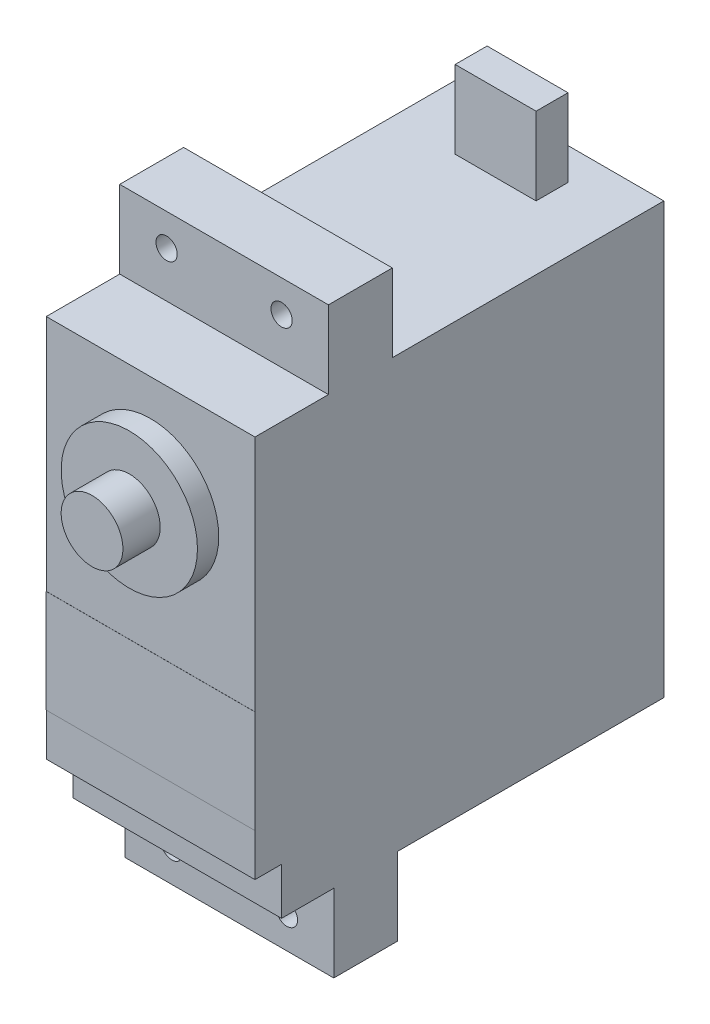
ISO-10303-21;
HEADER;
FILE_DESCRIPTION(('STEP AP214'),'2;1');
FILE_NAME('part.step','',(''),(''),'','','');
FILE_SCHEMA(('AUTOMOTIVE_DESIGN { 1 0 10303 214 1 1 1 1 }'));
ENDSEC;
DATA;
#1=APPLICATION_CONTEXT('core data for automotive mechanical design processes');
#2=APPLICATION_PROTOCOL_DEFINITION('international standard','automotive_design',2000,#1);
#3=PRODUCT_CONTEXT('',#1,'mechanical');
#4=PRODUCT('Part','Part','',(#3));
#5=PRODUCT_RELATED_PRODUCT_CATEGORY('part','',(#4));
#6=PRODUCT_DEFINITION_FORMATION('','',#4);
#7=PRODUCT_DEFINITION_CONTEXT('part definition',#1,'design');
#8=PRODUCT_DEFINITION('design','',#6,#7);
#9=PRODUCT_DEFINITION_SHAPE('','',#8);
#10=(LENGTH_UNIT() NAMED_UNIT(*) SI_UNIT(.MILLI.,.METRE.));
#11=(NAMED_UNIT(*) PLANE_ANGLE_UNIT() SI_UNIT($,.RADIAN.));
#12=(NAMED_UNIT(*) SI_UNIT($,.STERADIAN.) SOLID_ANGLE_UNIT());
#13=UNCERTAINTY_MEASURE_WITH_UNIT(LENGTH_MEASURE(1.E-05),#10,'distance_accuracy_value','');
#14=(GEOMETRIC_REPRESENTATION_CONTEXT(3) GLOBAL_UNCERTAINTY_ASSIGNED_CONTEXT((#13)) GLOBAL_UNIT_ASSIGNED_CONTEXT((#10,
#11,#12)) REPRESENTATION_CONTEXT('',''));
#15=CARTESIAN_POINT('',(0.,0.,0.));
#16=DIRECTION('',(0.,0.,1.));
#17=DIRECTION('',(1.,0.,0.));
#18=AXIS2_PLACEMENT_3D('',#15,#16,#17);
#19=CARTESIAN_POINT('',(0.,0.,38.4));
#20=DIRECTION('',(0.,0.,1.));
#21=DIRECTION('',(1.,0.,0.));
#22=AXIS2_PLACEMENT_3D('',#19,#20,#21);
#23=PLANE('',#22);
#24=DIRECTION('',(0.,1.,0.));
#25=VECTOR('',#24,1.);
#26=CARTESIAN_POINT('',(35.4646184858892,20.4232044198895,38.4));
#27=LINE('',#26,#25);
#28=CARTESIAN_POINT('',(35.4646184858892,-15.5767955801105,38.4));
#29=VERTEX_POINT('',#28);
#30=CARTESIAN_POINT('',(35.4646184858892,-11.5767955801105,38.4));
#31=VERTEX_POINT('',#30);
#32=EDGE_CURVE('E60',#29,#31,#27,.T.);
#33=ORIENTED_EDGE('',*,*,#32,.T.);
#34=DIRECTION('',(1.,0.,0.));
#35=VECTOR('',#34,1.);
#36=CARTESIAN_POINT('',(15.8646184858892,-11.5767955801105,38.4));
#37=LINE('',#36,#35);
#38=CARTESIAN_POINT('',(15.8646184858892,-11.5767955801105,38.4));
#39=VERTEX_POINT('',#38);
#40=EDGE_CURVE('E210',#39,#31,#37,.T.);
#41=ORIENTED_EDGE('',*,*,#40,.F.);
#42=DIRECTION('',(0.,-1.,0.));
#43=VECTOR('',#42,1.);
#44=CARTESIAN_POINT('',(15.8646184858892,20.4232044198895,38.4));
#45=LINE('',#44,#43);
#46=CARTESIAN_POINT('',(15.8646184858892,-15.5767955801105,38.4));
#47=VERTEX_POINT('',#46);
#48=EDGE_CURVE('E323',#39,#47,#45,.T.);
#49=ORIENTED_EDGE('',*,*,#48,.T.);
#50=DIRECTION('',(1.,0.,0.));
#51=VECTOR('',#50,1.);
#52=CARTESIAN_POINT('',(15.8646184858892,-15.5767955801105,38.4));
#53=LINE('',#52,#51);
#54=EDGE_CURVE('E322',#47,#29,#53,.T.);
#55=ORIENTED_EDGE('',*,*,#54,.T.);
#56=EDGE_LOOP('',(#33,#41,#49,#55));
#57=FACE_BOUND('',#56,.T.);
#58=ADVANCED_FACE('F35',(#57),#23,.T.);
#59=CARTESIAN_POINT('',(15.8646184858892,-19.9767955801105,35.9));
#60=DIRECTION('',(0.,1.,0.));
#61=DIRECTION('',(-1.,0.,0.));
#62=AXIS2_PLACEMENT_3D('',#59,#60,#61);
#63=PLANE('',#62);
#64=DIRECTION('',(1.,0.,0.));
#65=VECTOR('',#64,1.);
#66=CARTESIAN_POINT('',(0.,-19.9767955801105,25.));
#67=LINE('',#66,#65);
#68=CARTESIAN_POINT('',(15.8646184858892,-19.9767955801105,25.));
#69=VERTEX_POINT('',#68);
#70=CARTESIAN_POINT('',(35.4646184858892,-19.9767955801105,25.));
#71=VERTEX_POINT('',#70);
#72=EDGE_CURVE('E272',#69,#71,#67,.T.);
#73=ORIENTED_EDGE('',*,*,#72,.F.);
#74=DIRECTION('',(0.,0.,-1.));
#75=VECTOR('',#74,1.);
#76=CARTESIAN_POINT('',(15.8646184858892,-19.9767955801105,35.9));
#77=LINE('',#76,#75);
#78=CARTESIAN_POINT('',(15.8646184858892,-19.9767955801105,0.));
#79=VERTEX_POINT('',#78);
#80=EDGE_CURVE('E366',#69,#79,#77,.T.);
#81=ORIENTED_EDGE('',*,*,#80,.T.);
#82=DIRECTION('',(1.,0.,0.));
#83=VECTOR('',#82,1.);
#84=CARTESIAN_POINT('',(15.8646184858892,-19.9767955801105,0.));
#85=LINE('',#84,#83);
#86=CARTESIAN_POINT('',(35.4646184858892,-19.9767955801105,0.));
#87=VERTEX_POINT('',#86);
#88=EDGE_CURVE('E348',#79,#87,#85,.T.);
#89=ORIENTED_EDGE('',*,*,#88,.T.);
#90=DIRECTION('',(0.,0.,-1.));
#91=VECTOR('',#90,1.);
#92=CARTESIAN_POINT('',(35.4646184858892,-19.9767955801105,35.9));
#93=LINE('',#92,#91);
#94=EDGE_CURVE('E362',#71,#87,#93,.T.);
#95=ORIENTED_EDGE('',*,*,#94,.F.);
#96=EDGE_LOOP('',(#73,#81,#89,#95));
#97=FACE_BOUND('',#96,.T.);
#98=ADVANCED_FACE('F462',(#97),#63,.F.);
#99=CARTESIAN_POINT('',(15.8646184858892,20.4232044198895,35.9));
#100=DIRECTION('',(0.,-1.,0.));
#101=DIRECTION('',(0.,0.,-1.));
#102=AXIS2_PLACEMENT_3D('',#99,#100,#101);
#103=PLANE('',#102);
#104=DIRECTION('',(1.,0.,0.));
#105=VECTOR('',#104,1.);
#106=CARTESIAN_POINT('',(0.,20.4232044198895,3.));
#107=LINE('',#106,#105);
#108=CARTESIAN_POINT('',(21.8646184858892,20.4232044198895,3.));
#109=VERTEX_POINT('',#108);
#110=CARTESIAN_POINT('',(29.4646184858892,20.4232044198895,3.));
#111=VERTEX_POINT('',#110);
#112=EDGE_CURVE('E249',#109,#111,#107,.T.);
#113=ORIENTED_EDGE('',*,*,#112,.T.);
#114=DIRECTION('',(0.,0.,1.));
#115=VECTOR('',#114,1.);
#116=CARTESIAN_POINT('',(29.4646184858892,20.4232044198895,0.));
#117=LINE('',#116,#115);
#118=CARTESIAN_POINT('',(29.4646184858892,20.4232044198895,6.));
#119=VERTEX_POINT('',#118);
#120=EDGE_CURVE('E232',#111,#119,#117,.T.);
#121=ORIENTED_EDGE('',*,*,#120,.T.);
#122=DIRECTION('',(1.,0.,0.));
#123=VECTOR('',#122,1.);
#124=CARTESIAN_POINT('',(0.,20.4232044198895,6.));
#125=LINE('',#124,#123);
#126=CARTESIAN_POINT('',(21.8646184858892,20.4232044198895,6.));
#127=VERTEX_POINT('',#126);
#128=EDGE_CURVE('E240',#127,#119,#125,.T.);
#129=ORIENTED_EDGE('',*,*,#128,.F.);
#130=DIRECTION('',(0.,0.,1.));
#131=VECTOR('',#130,1.);
#132=CARTESIAN_POINT('',(21.8646184858892,20.4232044198895,0.));
#133=LINE('',#132,#131);
#134=EDGE_CURVE('E251',#109,#127,#133,.T.);
#135=ORIENTED_EDGE('',*,*,#134,.F.);
#136=EDGE_LOOP('',(#113,#121,#129,#135));
#137=FACE_BOUND('',#136,.T.);
#138=DIRECTION('',(-1.,0.,0.));
#139=VECTOR('',#138,1.);
#140=CARTESIAN_POINT('',(0.,20.4232044198895,25.4998346045456));
#141=LINE('',#140,#139);
#142=CARTESIAN_POINT('',(35.4646184858892,20.4232044198895,25.4998346045456));
#143=VERTEX_POINT('',#142);
#144=CARTESIAN_POINT('',(15.8646184858892,20.4232044198895,25.4998346045456));
#145=VERTEX_POINT('',#144);
#146=EDGE_CURVE('E298',#143,#145,#141,.T.);
#147=ORIENTED_EDGE('',*,*,#146,.F.);
#148=DIRECTION('',(0.,0.,-1.));
#149=VECTOR('',#148,1.);
#150=CARTESIAN_POINT('',(35.4646184858892,20.4232044198895,35.9));
#151=LINE('',#150,#149);
#152=CARTESIAN_POINT('',(35.4646184858892,20.4232044198895,0.));
#153=VERTEX_POINT('',#152);
#154=EDGE_CURVE('E359',#143,#153,#151,.T.);
#155=ORIENTED_EDGE('',*,*,#154,.T.);
#156=DIRECTION('',(-1.,0.,0.));
#157=VECTOR('',#156,1.);
#158=CARTESIAN_POINT('',(15.8646184858892,20.4232044198895,0.));
#159=LINE('',#158,#157);
#160=CARTESIAN_POINT('',(15.8646184858892,20.4232044198895,0.));
#161=VERTEX_POINT('',#160);
#162=EDGE_CURVE('E342',#153,#161,#159,.T.);
#163=ORIENTED_EDGE('',*,*,#162,.T.);
#164=DIRECTION('',(0.,0.,-1.));
#165=VECTOR('',#164,1.);
#166=CARTESIAN_POINT('',(15.8646184858892,20.4232044198895,35.9));
#167=LINE('',#166,#165);
#168=EDGE_CURVE('E346',#145,#161,#167,.T.);
#169=ORIENTED_EDGE('',*,*,#168,.F.);
#170=EDGE_LOOP('',(#147,#155,#163,#169));
#171=FACE_BOUND('',#170,.T.);
#172=ADVANCED_FACE('F421',(#137,#171),#103,.F.);
#173=CARTESIAN_POINT('',(15.8646184858892,20.4232044198895,35.9));
#174=DIRECTION('',(1.,0.,0.));
#175=DIRECTION('',(0.,1.,0.));
#176=AXIS2_PLACEMENT_3D('',#173,#174,#175);
#177=PLANE('',#176);
#178=DIRECTION('',(0.,-1.,0.));
#179=VECTOR('',#178,1.);
#180=CARTESIAN_POINT('',(15.8646184858892,20.4232044198895,0.));
#181=LINE('',#180,#179);
#182=EDGE_CURVE('E338',#161,#79,#181,.T.);
#183=ORIENTED_EDGE('',*,*,#182,.T.);
#184=ORIENTED_EDGE('',*,*,#80,.F.);
#185=DIRECTION('',(0.,1.,0.));
#186=VECTOR('',#185,1.);
#187=CARTESIAN_POINT('',(15.8646184858892,-27.2767955801105,25.));
#188=LINE('',#187,#186);
#189=CARTESIAN_POINT('',(15.8646184858892,-27.2767955801105,25.));
#190=VERTEX_POINT('',#189);
#191=EDGE_CURVE('E287',#190,#69,#188,.T.);
#192=ORIENTED_EDGE('',*,*,#191,.F.);
#193=DIRECTION('',(0.,0.,-1.));
#194=VECTOR('',#193,1.);
#195=CARTESIAN_POINT('',(15.8646184858892,-27.2767955801105,0.));
#196=LINE('',#195,#194);
#197=CARTESIAN_POINT('',(15.8646184858892,-27.2767955801105,31.));
#198=VERTEX_POINT('',#197);
#199=EDGE_CURVE('E271',#198,#190,#196,.T.);
#200=ORIENTED_EDGE('',*,*,#199,.F.);
#201=DIRECTION('',(0.,1.,0.));
#202=VECTOR('',#201,1.);
#203=CARTESIAN_POINT('',(15.8646184858892,-27.2767955801105,31.));
#204=LINE('',#203,#202);
#205=CARTESIAN_POINT('',(15.8646184858892,-19.9767955801105,31.));
#206=VERTEX_POINT('',#205);
#207=EDGE_CURVE('E290',#198,#206,#204,.T.);
#208=ORIENTED_EDGE('',*,*,#207,.T.);
#209=CARTESIAN_POINT('',(15.8646184858892,-19.9767955801105,35.9));
#210=VERTEX_POINT('',#209);
#211=EDGE_CURVE('E235',#210,#206,#77,.T.);
#212=ORIENTED_EDGE('',*,*,#211,.F.);
#213=DIRECTION('',(0.,-1.,0.));
#214=VECTOR('',#213,1.);
#215=CARTESIAN_POINT('',(15.8646184858892,20.4232044198895,35.9));
#216=LINE('',#215,#214);
#217=CARTESIAN_POINT('',(15.8646184858892,-15.5767955801105,35.9));
#218=VERTEX_POINT('',#217);
#219=EDGE_CURVE('E339',#218,#210,#216,.T.);
#220=ORIENTED_EDGE('',*,*,#219,.F.);
#221=DIRECTION('',(0.,0.,-1.));
#222=VECTOR('',#221,1.);
#223=CARTESIAN_POINT('',(15.8646184858892,-15.5767955801105,38.4));
#224=LINE('',#223,#222);
#225=EDGE_CURVE('E335',#47,#218,#224,.T.);
#226=ORIENTED_EDGE('',*,*,#225,.F.);
#227=ORIENTED_EDGE('',*,*,#48,.F.);
#228=DIRECTION('',(0.,0.,-1.));
#229=VECTOR('',#228,1.);
#230=CARTESIAN_POINT('',(15.8646184858892,-11.5767955801105,38.41));
#231=LINE('',#230,#229);
#232=CARTESIAN_POINT('',(15.8646184858892,-11.5767955801105,38.41));
#233=VERTEX_POINT('',#232);
#234=EDGE_CURVE('E208',#233,#39,#231,.T.);
#235=ORIENTED_EDGE('',*,*,#234,.F.);
#236=DIRECTION('',(0.,1.,0.));
#237=VECTOR('',#236,1.);
#238=CARTESIAN_POINT('',(15.8646184858892,-11.5767955801105,38.41));
#239=LINE('',#238,#237);
#240=CARTESIAN_POINT('',(15.8646184858892,-1.92679558011051,38.41));
#241=VERTEX_POINT('',#240);
#242=EDGE_CURVE('E200',#233,#241,#239,.T.);
#243=ORIENTED_EDGE('',*,*,#242,.T.);
#244=DIRECTION('',(0.,0.,-1.));
#245=VECTOR('',#244,1.);
#246=CARTESIAN_POINT('',(15.8646184858892,-1.92679558011051,38.41));
#247=LINE('',#246,#245);
#248=CARTESIAN_POINT('',(15.8646184858892,-1.92679558011051,38.4));
#249=VERTEX_POINT('',#248);
#250=EDGE_CURVE('E186',#241,#249,#247,.T.);
#251=ORIENTED_EDGE('',*,*,#250,.T.);
#252=CARTESIAN_POINT('',(15.8646184858892,20.4232044198895,38.4));
#253=VERTEX_POINT('',#252);
#254=EDGE_CURVE('E320',#253,#249,#45,.T.);
#255=ORIENTED_EDGE('',*,*,#254,.F.);
#256=CARTESIAN_POINT('',(15.8646184858892,20.4232044198895,31.4998346045456));
#257=VERTEX_POINT('',#256);
#258=EDGE_CURVE('E356',#253,#257,#167,.T.);
#259=ORIENTED_EDGE('',*,*,#258,.T.);
#260=DIRECTION('',(0.,-1.,0.));
#261=VECTOR('',#260,1.);
#262=CARTESIAN_POINT('',(15.8646184858892,27.7232044198895,31.4998346045456));
#263=LINE('',#262,#261);
#264=CARTESIAN_POINT('',(15.8646184858892,27.7232044198895,31.4998346045456));
#265=VERTEX_POINT('',#264);
#266=EDGE_CURVE('E304',#265,#257,#263,.T.);
#267=ORIENTED_EDGE('',*,*,#266,.F.);
#268=DIRECTION('',(0.,0.,1.));
#269=VECTOR('',#268,1.);
#270=CARTESIAN_POINT('',(15.8646184858892,27.7232044198895,0.));
#271=LINE('',#270,#269);
#272=CARTESIAN_POINT('',(15.8646184858892,27.7232044198895,25.4998346045456));
#273=VERTEX_POINT('',#272);
#274=EDGE_CURVE('E302',#273,#265,#271,.T.);
#275=ORIENTED_EDGE('',*,*,#274,.F.);
#276=DIRECTION('',(0.,-1.,0.));
#277=VECTOR('',#276,1.);
#278=CARTESIAN_POINT('',(15.8646184858892,27.7232044198895,25.4998346045456));
#279=LINE('',#278,#277);
#280=EDGE_CURVE('E310',#273,#145,#279,.T.);
#281=ORIENTED_EDGE('',*,*,#280,.T.);
#282=ORIENTED_EDGE('',*,*,#168,.T.);
#283=EDGE_LOOP('',(#183,#184,#192,#200,#208,#212,#220,#226,#227,#235,#243,#251,#255,#259,#267,
#275,#281,#282));
#284=FACE_BOUND('',#283,.T.);
#285=ADVANCED_FACE('F37',(#284),#177,.F.);
#286=ORIENTED_EDGE('',*,*,#211,.T.);
#287=DIRECTION('',(1.,0.,0.));
#288=VECTOR('',#287,1.);
#289=CARTESIAN_POINT('',(0.,-19.9767955801105,31.));
#290=LINE('',#289,#288);
#291=CARTESIAN_POINT('',(35.4646184858892,-19.9767955801105,31.));
#292=VERTEX_POINT('',#291);
#293=EDGE_CURVE('E267',#206,#292,#290,.T.);
#294=ORIENTED_EDGE('',*,*,#293,.T.);
#295=CARTESIAN_POINT('',(35.4646184858892,-19.9767955801105,35.9));
#296=VERTEX_POINT('',#295);
#297=EDGE_CURVE('E363',#296,#292,#93,.T.);
#298=ORIENTED_EDGE('',*,*,#297,.F.);
#299=DIRECTION('',(1.,0.,0.));
#300=VECTOR('',#299,1.);
#301=CARTESIAN_POINT('',(15.8646184858892,-19.9767955801105,35.9));
#302=LINE('',#301,#300);
#303=EDGE_CURVE('E341',#210,#296,#302,.T.);
#304=ORIENTED_EDGE('',*,*,#303,.F.);
#305=EDGE_LOOP('',(#286,#294,#298,#304));
#306=FACE_BOUND('',#305,.T.);
#307=ADVANCED_FACE('F448',(#306),#63,.F.);
#308=CARTESIAN_POINT('',(35.4646184858892,20.4232044198895,35.9));
#309=DIRECTION('',(-1.,0.,0.));
#310=DIRECTION('',(0.,0.,1.));
#311=AXIS2_PLACEMENT_3D('',#308,#309,#310);
#312=PLANE('',#311);
#313=DIRECTION('',(0.,1.,0.));
#314=VECTOR('',#313,1.);
#315=CARTESIAN_POINT('',(35.4646184858892,20.4232044198895,0.));
#316=LINE('',#315,#314);
#317=EDGE_CURVE('E351',#87,#153,#316,.T.);
#318=ORIENTED_EDGE('',*,*,#317,.T.);
#319=ORIENTED_EDGE('',*,*,#154,.F.);
#320=DIRECTION('',(0.,-1.,0.));
#321=VECTOR('',#320,1.);
#322=CARTESIAN_POINT('',(35.4646184858892,27.7232044198895,25.4998346045456));
#323=LINE('',#322,#321);
#324=CARTESIAN_POINT('',(35.4646184858892,27.7232044198895,25.4998346045456));
#325=VERTEX_POINT('',#324);
#326=EDGE_CURVE('E313',#325,#143,#323,.T.);
#327=ORIENTED_EDGE('',*,*,#326,.F.);
#328=DIRECTION('',(0.,0.,-1.));
#329=VECTOR('',#328,1.);
#330=CARTESIAN_POINT('',(35.4646184858892,27.7232044198895,0.));
#331=LINE('',#330,#329);
#332=CARTESIAN_POINT('',(35.4646184858892,27.7232044198895,31.4998346045456));
#333=VERTEX_POINT('',#332);
#334=EDGE_CURVE('E297',#333,#325,#331,.T.);
#335=ORIENTED_EDGE('',*,*,#334,.F.);
#336=DIRECTION('',(0.,-1.,0.));
#337=VECTOR('',#336,1.);
#338=CARTESIAN_POINT('',(35.4646184858892,27.7232044198895,31.4998346045456));
#339=LINE('',#338,#337);
#340=CARTESIAN_POINT('',(35.4646184858892,20.4232044198895,31.4998346045456));
#341=VERTEX_POINT('',#340);
#342=EDGE_CURVE('E316',#333,#341,#339,.T.);
#343=ORIENTED_EDGE('',*,*,#342,.T.);
#344=CARTESIAN_POINT('',(35.4646184858892,20.4232044198895,38.4));
#345=VERTEX_POINT('',#344);
#346=EDGE_CURVE('E360',#345,#341,#151,.T.);
#347=ORIENTED_EDGE('',*,*,#346,.F.);
#348=CARTESIAN_POINT('',(35.4646184858892,-1.92679558011051,38.4));
#349=VERTEX_POINT('',#348);
#350=EDGE_CURVE('E325',#349,#345,#27,.T.);
#351=ORIENTED_EDGE('',*,*,#350,.F.);
#352=DIRECTION('',(0.,0.,-1.));
#353=VECTOR('',#352,1.);
#354=CARTESIAN_POINT('',(35.4646184858892,-1.92679558011051,38.41));
#355=LINE('',#354,#353);
#356=CARTESIAN_POINT('',(35.4646184858892,-1.92679558011051,38.41));
#357=VERTEX_POINT('',#356);
#358=EDGE_CURVE('E194',#357,#349,#355,.T.);
#359=ORIENTED_EDGE('',*,*,#358,.F.);
#360=DIRECTION('',(0.,1.,0.));
#361=VECTOR('',#360,1.);
#362=CARTESIAN_POINT('',(35.4646184858892,-11.5767955801105,38.41));
#363=LINE('',#362,#361);
#364=CARTESIAN_POINT('',(35.4646184858892,-11.5767955801105,38.41));
#365=VERTEX_POINT('',#364);
#366=EDGE_CURVE('E202',#365,#357,#363,.T.);
#367=ORIENTED_EDGE('',*,*,#366,.F.);
#368=DIRECTION('',(0.,0.,-1.));
#369=VECTOR('',#368,1.);
#370=CARTESIAN_POINT('',(35.4646184858892,-11.5767955801105,38.41));
#371=LINE('',#370,#369);
#372=EDGE_CURVE('E223',#365,#31,#371,.T.);
#373=ORIENTED_EDGE('',*,*,#372,.T.);
#374=ORIENTED_EDGE('',*,*,#32,.F.);
#375=DIRECTION('',(0.,0.,-1.));
#376=VECTOR('',#375,1.);
#377=CARTESIAN_POINT('',(35.4646184858892,-15.5767955801105,38.4));
#378=LINE('',#377,#376);
#379=CARTESIAN_POINT('',(35.4646184858892,-15.5767955801105,35.9));
#380=VERTEX_POINT('',#379);
#381=EDGE_CURVE('E330',#29,#380,#378,.T.);
#382=ORIENTED_EDGE('',*,*,#381,.T.);
#383=DIRECTION('',(0.,1.,0.));
#384=VECTOR('',#383,1.);
#385=CARTESIAN_POINT('',(35.4646184858892,20.4232044198895,35.9));
#386=LINE('',#385,#384);
#387=EDGE_CURVE('E344',#296,#380,#386,.T.);
#388=ORIENTED_EDGE('',*,*,#387,.F.);
#389=ORIENTED_EDGE('',*,*,#297,.T.);
#390=DIRECTION('',(0.,1.,0.));
#391=VECTOR('',#390,1.);
#392=CARTESIAN_POINT('',(35.4646184858892,-27.2767955801105,31.));
#393=LINE('',#392,#391);
#394=CARTESIAN_POINT('',(35.4646184858892,-27.2767955801105,31.));
#395=VERTEX_POINT('',#394);
#396=EDGE_CURVE('E278',#395,#292,#393,.T.);
#397=ORIENTED_EDGE('',*,*,#396,.F.);
#398=DIRECTION('',(0.,0.,1.));
#399=VECTOR('',#398,1.);
#400=CARTESIAN_POINT('',(35.4646184858892,-27.2767955801105,0.));
#401=LINE('',#400,#399);
#402=CARTESIAN_POINT('',(35.4646184858892,-27.2767955801105,25.));
#403=VERTEX_POINT('',#402);
#404=EDGE_CURVE('E276',#403,#395,#401,.T.);
#405=ORIENTED_EDGE('',*,*,#404,.F.);
#406=DIRECTION('',(0.,1.,0.));
#407=VECTOR('',#406,1.);
#408=CARTESIAN_POINT('',(35.4646184858892,-27.2767955801105,25.));
#409=LINE('',#408,#407);
#410=EDGE_CURVE('E284',#403,#71,#409,.T.);
#411=ORIENTED_EDGE('',*,*,#410,.T.);
#412=ORIENTED_EDGE('',*,*,#94,.T.);
#413=EDGE_LOOP('',(#318,#319,#327,#335,#343,#347,#351,#359,#367,#373,#374,#382,#388,#389,#397,
#405,#411,#412));
#414=FACE_BOUND('',#413,.T.);
#415=ADVANCED_FACE('F411',(#414),#312,.F.);
#416=ORIENTED_EDGE('',*,*,#346,.T.);
#417=DIRECTION('',(-1.,0.,0.));
#418=VECTOR('',#417,1.);
#419=CARTESIAN_POINT('',(0.,20.4232044198895,31.4998346045456));
#420=LINE('',#419,#418);
#421=EDGE_CURVE('E293',#341,#257,#420,.T.);
#422=ORIENTED_EDGE('',*,*,#421,.T.);
#423=ORIENTED_EDGE('',*,*,#258,.F.);
#424=DIRECTION('',(-1.,0.,0.));
#425=VECTOR('',#424,1.);
#426=CARTESIAN_POINT('',(15.8646184858892,20.4232044198895,38.4));
#427=LINE('',#426,#425);
#428=EDGE_CURVE('E327',#345,#253,#427,.T.);
#429=ORIENTED_EDGE('',*,*,#428,.F.);
#430=EDGE_LOOP('',(#416,#422,#423,#429));
#431=FACE_BOUND('',#430,.T.);
#432=ADVANCED_FACE('F405',(#431),#103,.F.);
#433=CARTESIAN_POINT('',(0.,0.,35.9));
#434=DIRECTION('',(0.,0.,1.));
#435=DIRECTION('',(1.,0.,0.));
#436=AXIS2_PLACEMENT_3D('',#433,#434,#435);
#437=PLANE('',#436);
#438=DIRECTION('',(1.,0.,0.));
#439=VECTOR('',#438,1.);
#440=CARTESIAN_POINT('',(15.8646184858892,-15.5767955801105,35.9));
#441=LINE('',#440,#439);
#442=EDGE_CURVE('E319',#218,#380,#441,.T.);
#443=ORIENTED_EDGE('',*,*,#442,.F.);
#444=ORIENTED_EDGE('',*,*,#219,.T.);
#445=ORIENTED_EDGE('',*,*,#303,.T.);
#446=ORIENTED_EDGE('',*,*,#387,.T.);
#447=EDGE_LOOP('',(#443,#444,#445,#446));
#448=FACE_BOUND('',#447,.T.);
#449=ADVANCED_FACE('F453',(#448),#437,.T.);
#450=CARTESIAN_POINT('',(0.,0.,0.));
#451=DIRECTION('',(0.,0.,1.));
#452=DIRECTION('',(1.,0.,0.));
#453=AXIS2_PLACEMENT_3D('',#450,#451,#452);
#454=PLANE('',#453);
#455=ORIENTED_EDGE('',*,*,#182,.F.);
#456=ORIENTED_EDGE('',*,*,#162,.F.);
#457=ORIENTED_EDGE('',*,*,#317,.F.);
#458=ORIENTED_EDGE('',*,*,#88,.F.);
#459=EDGE_LOOP('',(#455,#456,#457,#458));
#460=FACE_BOUND('',#459,.T.);
#461=ADVANCED_FACE('F427',(#460),#454,.F.);
#462=CARTESIAN_POINT('',(15.8646184858892,-15.5767955801105,38.4));
#463=DIRECTION('',(0.,1.,0.));
#464=DIRECTION('',(0.,0.,1.));
#465=AXIS2_PLACEMENT_3D('',#462,#463,#464);
#466=PLANE('',#465);
#467=ORIENTED_EDGE('',*,*,#442,.T.);
#468=ORIENTED_EDGE('',*,*,#381,.F.);
#469=ORIENTED_EDGE('',*,*,#54,.F.);
#470=ORIENTED_EDGE('',*,*,#225,.T.);
#471=EDGE_LOOP('',(#467,#468,#469,#470));
#472=FACE_BOUND('',#471,.T.);
#473=ADVANCED_FACE('F455',(#472),#466,.F.);
#474=DIRECTION('',(1.,0.,0.));
#475=VECTOR('',#474,1.);
#476=CARTESIAN_POINT('',(15.8646184858892,-1.92679558011051,38.4));
#477=LINE('',#476,#475);
#478=EDGE_CURVE('E52',#249,#349,#477,.T.);
#479=ORIENTED_EDGE('',*,*,#478,.T.);
#480=ORIENTED_EDGE('',*,*,#350,.T.);
#481=ORIENTED_EDGE('',*,*,#428,.T.);
#482=ORIENTED_EDGE('',*,*,#254,.T.);
#483=EDGE_LOOP('',(#479,#480,#481,#482));
#484=FACE_BOUND('',#483,.T.);
#485=CARTESIAN_POINT('',(25.6646184858892,10.6232044198895,38.4));
#486=DIRECTION('',(0.,0.,1.));
#487=DIRECTION('',(1.,0.,0.));
#488=AXIS2_PLACEMENT_3D('',#485,#486,#487);
#489=CIRCLE('',#488,6.40000000000001);
#490=CARTESIAN_POINT('',(32.0646184858892,10.6232044198895,38.4));
#491=VERTEX_POINT('',#490);
#492=EDGE_CURVE('E44',#491,#491,#489,.T.);
#493=ORIENTED_EDGE('',*,*,#492,.F.);
#494=EDGE_LOOP('',(#493));
#495=FACE_BOUND('',#494,.T.);
#496=ADVANCED_FACE('F396',(#484,#495),#23,.T.);
#497=CARTESIAN_POINT('',(0.,27.7232044198895,31.4998346045456));
#498=DIRECTION('',(0.,0.,1.));
#499=DIRECTION('',(1.,0.,0.));
#500=AXIS2_PLACEMENT_3D('',#497,#498,#499);
#501=PLANE('',#500);
#502=CARTESIAN_POINT('',(20.2646184858892,24.7232044198895,31.4998346045456));
#503=DIRECTION('',(0.,0.,1.));
#504=DIRECTION('',(1.,0.,0.));
#505=AXIS2_PLACEMENT_3D('',#502,#503,#504);
#506=CIRCLE('',#505,1.);
#507=CARTESIAN_POINT('',(21.2646184858892,24.7232044198895,31.4998346045456));
#508=VERTEX_POINT('',#507);
#509=EDGE_CURVE('E372',#508,#508,#506,.T.);
#510=ORIENTED_EDGE('',*,*,#509,.F.);
#511=EDGE_LOOP('',(#510));
#512=FACE_BOUND('',#511,.T.);
#513=CARTESIAN_POINT('',(31.0646184858892,24.7232044198895,31.4998346045456));
#514=DIRECTION('',(0.,0.,1.));
#515=DIRECTION('',(1.,0.,0.));
#516=AXIS2_PLACEMENT_3D('',#513,#514,#515);
#517=CIRCLE('',#516,0.999999999999998);
#518=CARTESIAN_POINT('',(32.0646184858892,24.7232044198895,31.4998346045456));
#519=VERTEX_POINT('',#518);
#520=EDGE_CURVE('E214',#519,#519,#517,.T.);
#521=ORIENTED_EDGE('',*,*,#520,.F.);
#522=EDGE_LOOP('',(#521));
#523=FACE_BOUND('',#522,.T.);
#524=ORIENTED_EDGE('',*,*,#421,.F.);
#525=ORIENTED_EDGE('',*,*,#342,.F.);
#526=DIRECTION('',(-1.,0.,0.));
#527=VECTOR('',#526,1.);
#528=CARTESIAN_POINT('',(0.,27.7232044198895,31.4998346045456));
#529=LINE('',#528,#527);
#530=EDGE_CURVE('E294',#333,#265,#529,.T.);
#531=ORIENTED_EDGE('',*,*,#530,.T.);
#532=ORIENTED_EDGE('',*,*,#266,.T.);
#533=EDGE_LOOP('',(#524,#525,#531,#532));
#534=FACE_BOUND('',#533,.T.);
#535=ADVANCED_FACE('F392',(#512,#523,#534),#501,.T.);
#536=CARTESIAN_POINT('',(0.,27.7232044198895,25.4998346045456));
#537=DIRECTION('',(0.,0.,1.));
#538=DIRECTION('',(1.,0.,0.));
#539=AXIS2_PLACEMENT_3D('',#536,#537,#538);
#540=PLANE('',#539);
#541=CARTESIAN_POINT('',(20.2646184858892,24.7232044198895,25.4998346045456));
#542=DIRECTION('',(0.,0.,1.));
#543=DIRECTION('',(1.,0.,0.));
#544=AXIS2_PLACEMENT_3D('',#541,#542,#543);
#545=CIRCLE('',#544,1.);
#546=CARTESIAN_POINT('',(21.2646184858892,24.7232044198895,25.4998346045456));
#547=VERTEX_POINT('',#546);
#548=EDGE_CURVE('E370',#547,#547,#545,.T.);
#549=ORIENTED_EDGE('',*,*,#548,.T.);
#550=EDGE_LOOP('',(#549));
#551=FACE_BOUND('',#550,.T.);
#552=CARTESIAN_POINT('',(31.0646184858892,24.7232044198895,25.4998346045456));
#553=DIRECTION('',(0.,0.,1.));
#554=DIRECTION('',(1.,0.,0.));
#555=AXIS2_PLACEMENT_3D('',#552,#553,#554);
#556=CIRCLE('',#555,0.999999999999998);
#557=CARTESIAN_POINT('',(32.0646184858892,24.7232044198895,25.4998346045456));
#558=VERTEX_POINT('',#557);
#559=EDGE_CURVE('E219',#558,#558,#556,.T.);
#560=ORIENTED_EDGE('',*,*,#559,.T.);
#561=EDGE_LOOP('',(#560));
#562=FACE_BOUND('',#561,.T.);
#563=ORIENTED_EDGE('',*,*,#146,.T.);
#564=ORIENTED_EDGE('',*,*,#280,.F.);
#565=DIRECTION('',(-1.,0.,0.));
#566=VECTOR('',#565,1.);
#567=CARTESIAN_POINT('',(0.,27.7232044198895,25.4998346045456));
#568=LINE('',#567,#566);
#569=EDGE_CURVE('E300',#325,#273,#568,.T.);
#570=ORIENTED_EDGE('',*,*,#569,.F.);
#571=ORIENTED_EDGE('',*,*,#326,.T.);
#572=EDGE_LOOP('',(#563,#564,#570,#571));
#573=FACE_BOUND('',#572,.T.);
#574=ADVANCED_FACE('F395',(#551,#562,#573),#540,.F.);
#575=CARTESIAN_POINT('',(0.,27.7232044198895,0.));
#576=DIRECTION('',(0.,1.,0.));
#577=DIRECTION('',(0.,0.,1.));
#578=AXIS2_PLACEMENT_3D('',#575,#576,#577);
#579=PLANE('',#578);
#580=ORIENTED_EDGE('',*,*,#530,.F.);
#581=ORIENTED_EDGE('',*,*,#334,.T.);
#582=ORIENTED_EDGE('',*,*,#569,.T.);
#583=ORIENTED_EDGE('',*,*,#274,.T.);
#584=EDGE_LOOP('',(#580,#581,#582,#583));
#585=FACE_BOUND('',#584,.T.);
#586=ADVANCED_FACE('F417',(#585),#579,.T.);
#587=CARTESIAN_POINT('',(0.,-27.2767955801105,31.));
#588=DIRECTION('',(0.,0.,1.));
#589=DIRECTION('',(1.,0.,0.));
#590=AXIS2_PLACEMENT_3D('',#587,#588,#589);
#591=PLANE('',#590);
#592=CARTESIAN_POINT('',(20.2646184858892,-24.2767955801105,31.));
#593=DIRECTION('',(0.,0.,1.));
#594=DIRECTION('',(1.,0.,0.));
#595=AXIS2_PLACEMENT_3D('',#592,#593,#594);
#596=CIRCLE('',#595,1.);
#597=CARTESIAN_POINT('',(21.2646184858892,-24.2767955801105,31.));
#598=VERTEX_POINT('',#597);
#599=EDGE_CURVE('E375',#598,#598,#596,.T.);
#600=ORIENTED_EDGE('',*,*,#599,.F.);
#601=EDGE_LOOP('',(#600));
#602=FACE_BOUND('',#601,.T.);
#603=CARTESIAN_POINT('',(31.0646184858892,-24.2767955801105,31.));
#604=DIRECTION('',(0.,0.,1.));
#605=DIRECTION('',(1.,0.,0.));
#606=AXIS2_PLACEMENT_3D('',#603,#604,#605);
#607=CIRCLE('',#606,0.999999999999991);
#608=CARTESIAN_POINT('',(32.0646184858892,-24.2767955801105,31.));
#609=VERTEX_POINT('',#608);
#610=EDGE_CURVE('E380',#609,#609,#607,.T.);
#611=ORIENTED_EDGE('',*,*,#610,.F.);
#612=EDGE_LOOP('',(#611));
#613=FACE_BOUND('',#612,.T.);
#614=ORIENTED_EDGE('',*,*,#293,.F.);
#615=ORIENTED_EDGE('',*,*,#207,.F.);
#616=DIRECTION('',(1.,0.,0.));
#617=VECTOR('',#616,1.);
#618=CARTESIAN_POINT('',(0.,-27.2767955801105,31.));
#619=LINE('',#618,#617);
#620=EDGE_CURVE('E268',#198,#395,#619,.T.);
#621=ORIENTED_EDGE('',*,*,#620,.T.);
#622=ORIENTED_EDGE('',*,*,#396,.T.);
#623=EDGE_LOOP('',(#614,#615,#621,#622));
#624=FACE_BOUND('',#623,.T.);
#625=ADVANCED_FACE('F445',(#602,#613,#624),#591,.T.);
#626=CARTESIAN_POINT('',(0.,-27.2767955801105,25.));
#627=DIRECTION('',(0.,0.,1.));
#628=DIRECTION('',(1.,0.,0.));
#629=AXIS2_PLACEMENT_3D('',#626,#627,#628);
#630=PLANE('',#629);
#631=CARTESIAN_POINT('',(20.2646184858892,-24.2767955801105,25.));
#632=DIRECTION('',(0.,0.,1.));
#633=DIRECTION('',(1.,0.,0.));
#634=AXIS2_PLACEMENT_3D('',#631,#632,#633);
#635=CIRCLE('',#634,1.);
#636=CARTESIAN_POINT('',(21.2646184858892,-24.2767955801105,25.));
#637=VERTEX_POINT('',#636);
#638=EDGE_CURVE('E39',#637,#637,#635,.T.);
#639=ORIENTED_EDGE('',*,*,#638,.T.);
#640=EDGE_LOOP('',(#639));
#641=FACE_BOUND('',#640,.T.);
#642=CARTESIAN_POINT('',(31.0646184858892,-24.2767955801105,25.));
#643=DIRECTION('',(0.,0.,1.));
#644=DIRECTION('',(1.,0.,0.));
#645=AXIS2_PLACEMENT_3D('',#642,#643,#644);
#646=CIRCLE('',#645,0.999999999999991);
#647=CARTESIAN_POINT('',(32.0646184858892,-24.2767955801105,25.));
#648=VERTEX_POINT('',#647);
#649=EDGE_CURVE('E373',#648,#648,#646,.T.);
#650=ORIENTED_EDGE('',*,*,#649,.T.);
#651=EDGE_LOOP('',(#650));
#652=FACE_BOUND('',#651,.T.);
#653=ORIENTED_EDGE('',*,*,#72,.T.);
#654=ORIENTED_EDGE('',*,*,#410,.F.);
#655=DIRECTION('',(1.,0.,0.));
#656=VECTOR('',#655,1.);
#657=CARTESIAN_POINT('',(0.,-27.2767955801105,25.));
#658=LINE('',#657,#656);
#659=EDGE_CURVE('E274',#190,#403,#658,.T.);
#660=ORIENTED_EDGE('',*,*,#659,.F.);
#661=ORIENTED_EDGE('',*,*,#191,.T.);
#662=EDGE_LOOP('',(#653,#654,#660,#661));
#663=FACE_BOUND('',#662,.T.);
#664=ADVANCED_FACE('F434',(#641,#652,#663),#630,.F.);
#665=CARTESIAN_POINT('',(0.,-27.2767955801105,0.));
#666=DIRECTION('',(0.,-1.,0.));
#667=DIRECTION('',(1.,0.,0.));
#668=AXIS2_PLACEMENT_3D('',#665,#666,#667);
#669=PLANE('',#668);
#670=ORIENTED_EDGE('',*,*,#620,.F.);
#671=ORIENTED_EDGE('',*,*,#199,.T.);
#672=ORIENTED_EDGE('',*,*,#659,.T.);
#673=ORIENTED_EDGE('',*,*,#404,.T.);
#674=EDGE_LOOP('',(#670,#671,#672,#673));
#675=FACE_BOUND('',#674,.T.);
#676=ADVANCED_FACE('F439',(#675),#669,.T.);
#677=CARTESIAN_POINT('',(29.4646184858892,27.7232044198895,0.));
#678=DIRECTION('',(1.,0.,0.));
#679=DIRECTION('',(0.,0.,-1.));
#680=AXIS2_PLACEMENT_3D('',#677,#678,#679);
#681=PLANE('',#680);
#682=ORIENTED_EDGE('',*,*,#120,.F.);
#683=DIRECTION('',(0.,-1.,0.));
#684=VECTOR('',#683,1.);
#685=CARTESIAN_POINT('',(29.4646184858892,27.7232044198895,3.));
#686=LINE('',#685,#684);
#687=CARTESIAN_POINT('',(29.4646184858892,27.7232044198895,3.));
#688=VERTEX_POINT('',#687);
#689=EDGE_CURVE('E264',#688,#111,#686,.T.);
#690=ORIENTED_EDGE('',*,*,#689,.F.);
#691=DIRECTION('',(0.,0.,1.));
#692=VECTOR('',#691,1.);
#693=CARTESIAN_POINT('',(29.4646184858892,27.7232044198895,0.));
#694=LINE('',#693,#692);
#695=CARTESIAN_POINT('',(29.4646184858892,27.7232044198895,6.));
#696=VERTEX_POINT('',#695);
#697=EDGE_CURVE('E236',#688,#696,#694,.T.);
#698=ORIENTED_EDGE('',*,*,#697,.T.);
#699=DIRECTION('',(0.,-1.,0.));
#700=VECTOR('',#699,1.);
#701=CARTESIAN_POINT('',(29.4646184858892,27.7232044198895,6.));
#702=LINE('',#701,#700);
#703=EDGE_CURVE('E247',#696,#119,#702,.T.);
#704=ORIENTED_EDGE('',*,*,#703,.T.);
#705=EDGE_LOOP('',(#682,#690,#698,#704));
#706=FACE_BOUND('',#705,.T.);
#707=ADVANCED_FACE('F500',(#706),#681,.T.);
#708=CARTESIAN_POINT('',(0.,27.7232044198895,3.));
#709=DIRECTION('',(0.,0.,-1.));
#710=DIRECTION('',(-1.,0.,0.));
#711=AXIS2_PLACEMENT_3D('',#708,#709,#710);
#712=PLANE('',#711);
#713=ORIENTED_EDGE('',*,*,#112,.F.);
#714=DIRECTION('',(0.,-1.,0.));
#715=VECTOR('',#714,1.);
#716=CARTESIAN_POINT('',(21.8646184858892,27.7232044198895,3.));
#717=LINE('',#716,#715);
#718=CARTESIAN_POINT('',(21.8646184858892,27.7232044198895,3.));
#719=VERTEX_POINT('',#718);
#720=EDGE_CURVE('E261',#719,#109,#717,.T.);
#721=ORIENTED_EDGE('',*,*,#720,.F.);
#722=DIRECTION('',(1.,0.,0.));
#723=VECTOR('',#722,1.);
#724=CARTESIAN_POINT('',(0.,27.7232044198895,3.));
#725=LINE('',#724,#723);
#726=EDGE_CURVE('E239',#719,#688,#725,.T.);
#727=ORIENTED_EDGE('',*,*,#726,.T.);
#728=ORIENTED_EDGE('',*,*,#689,.T.);
#729=EDGE_LOOP('',(#713,#721,#727,#728));
#730=FACE_BOUND('',#729,.T.);
#731=ADVANCED_FACE('F496',(#730),#712,.T.);
#732=CARTESIAN_POINT('',(21.8646184858892,27.7232044198895,0.));
#733=DIRECTION('',(1.,0.,0.));
#734=DIRECTION('',(0.,0.,-1.));
#735=AXIS2_PLACEMENT_3D('',#732,#733,#734);
#736=PLANE('',#735);
#737=ORIENTED_EDGE('',*,*,#134,.T.);
#738=DIRECTION('',(0.,-1.,0.));
#739=VECTOR('',#738,1.);
#740=CARTESIAN_POINT('',(21.8646184858892,27.7232044198895,6.));
#741=LINE('',#740,#739);
#742=CARTESIAN_POINT('',(21.8646184858892,27.7232044198895,6.));
#743=VERTEX_POINT('',#742);
#744=EDGE_CURVE('E258',#743,#127,#741,.T.);
#745=ORIENTED_EDGE('',*,*,#744,.F.);
#746=DIRECTION('',(0.,0.,1.));
#747=VECTOR('',#746,1.);
#748=CARTESIAN_POINT('',(21.8646184858892,27.7232044198895,0.));
#749=LINE('',#748,#747);
#750=EDGE_CURVE('E243',#719,#743,#749,.T.);
#751=ORIENTED_EDGE('',*,*,#750,.F.);
#752=ORIENTED_EDGE('',*,*,#720,.T.);
#753=EDGE_LOOP('',(#737,#745,#751,#752));
#754=FACE_BOUND('',#753,.T.);
#755=ADVANCED_FACE('F507',(#754),#736,.F.);
#756=CARTESIAN_POINT('',(0.,27.7232044198895,6.));
#757=DIRECTION('',(0.,0.,-1.));
#758=DIRECTION('',(-1.,0.,0.));
#759=AXIS2_PLACEMENT_3D('',#756,#757,#758);
#760=PLANE('',#759);
#761=ORIENTED_EDGE('',*,*,#128,.T.);
#762=ORIENTED_EDGE('',*,*,#703,.F.);
#763=DIRECTION('',(1.,0.,0.));
#764=VECTOR('',#763,1.);
#765=CARTESIAN_POINT('',(0.,27.7232044198895,6.));
#766=LINE('',#765,#764);
#767=EDGE_CURVE('E245',#743,#696,#766,.T.);
#768=ORIENTED_EDGE('',*,*,#767,.F.);
#769=ORIENTED_EDGE('',*,*,#744,.T.);
#770=EDGE_LOOP('',(#761,#762,#768,#769));
#771=FACE_BOUND('',#770,.T.);
#772=ADVANCED_FACE('F504',(#771),#760,.F.);
#773=CARTESIAN_POINT('',(0.,27.7232044198895,0.));
#774=DIRECTION('',(0.,1.,0.));
#775=DIRECTION('',(0.,0.,1.));
#776=AXIS2_PLACEMENT_3D('',#773,#774,#775);
#777=PLANE('',#776);
#778=ORIENTED_EDGE('',*,*,#697,.F.);
#779=ORIENTED_EDGE('',*,*,#726,.F.);
#780=ORIENTED_EDGE('',*,*,#750,.T.);
#781=ORIENTED_EDGE('',*,*,#767,.T.);
#782=EDGE_LOOP('',(#778,#779,#780,#781));
#783=FACE_BOUND('',#782,.T.);
#784=ADVANCED_FACE('F510',(#783),#777,.T.);
#785=CARTESIAN_POINT('',(25.6646184858892,10.6232044198895,40.4));
#786=DIRECTION('',(0.,0.,-1.));
#787=DIRECTION('',(-1.,0.,0.));
#788=AXIS2_PLACEMENT_3D('',#785,#786,#787);
#789=CYLINDRICAL_SURFACE('',#788,6.40000000000001);
#790=CARTESIAN_POINT('',(25.6646184858892,10.6232044198895,40.4));
#791=DIRECTION('',(0.,0.,1.));
#792=DIRECTION('',(1.,0.,0.));
#793=AXIS2_PLACEMENT_3D('',#790,#791,#792);
#794=CIRCLE('',#793,6.40000000000001);
#795=CARTESIAN_POINT('',(32.0646184858892,10.6232044198895,40.4));
#796=VERTEX_POINT('',#795);
#797=EDGE_CURVE('E228',#796,#796,#794,.T.);
#798=ORIENTED_EDGE('',*,*,#797,.F.);
#799=EDGE_LOOP('',(#798));
#800=FACE_BOUND('',#799,.T.);
#801=ORIENTED_EDGE('',*,*,#492,.T.);
#802=EDGE_LOOP('',(#801));
#803=FACE_BOUND('',#802,.T.);
#804=ADVANCED_FACE('F512',(#800,#803),#789,.T.);
#805=CARTESIAN_POINT('',(25.6646184858892,10.6232044198895,40.4));
#806=DIRECTION('',(0.,0.,1.));
#807=DIRECTION('',(1.,0.,0.));
#808=AXIS2_PLACEMENT_3D('',#805,#806,#807);
#809=PLANE('',#808);
#810=CARTESIAN_POINT('',(25.6646184858892,10.6232044198895,40.4));
#811=DIRECTION('',(0.,0.,1.));
#812=DIRECTION('',(1.,0.,0.));
#813=AXIS2_PLACEMENT_3D('',#810,#811,#812);
#814=CIRCLE('',#813,2.9);
#815=CARTESIAN_POINT('',(28.5646184858892,10.6232044198895,40.4));
#816=VERTEX_POINT('',#815);
#817=EDGE_CURVE('E11',#816,#816,#814,.T.);
#818=ORIENTED_EDGE('',*,*,#817,.F.);
#819=EDGE_LOOP('',(#818));
#820=FACE_BOUND('',#819,.T.);
#821=ORIENTED_EDGE('',*,*,#797,.T.);
#822=EDGE_LOOP('',(#821));
#823=FACE_BOUND('',#822,.T.);
#824=ADVANCED_FACE('F518',(#820,#823),#809,.T.);
#825=CARTESIAN_POINT('',(25.6646184858892,10.6232044198895,43.9));
#826=DIRECTION('',(0.,0.,-1.));
#827=DIRECTION('',(-1.,0.,0.));
#828=AXIS2_PLACEMENT_3D('',#825,#826,#827);
#829=CYLINDRICAL_SURFACE('',#828,2.9);
#830=CARTESIAN_POINT('',(25.6646184858892,10.6232044198895,43.9));
#831=DIRECTION('',(0.,0.,1.));
#832=DIRECTION('',(1.,0.,0.));
#833=AXIS2_PLACEMENT_3D('',#830,#831,#832);
#834=CIRCLE('',#833,2.9);
#835=CARTESIAN_POINT('',(28.5646184858892,10.6232044198895,43.9));
#836=VERTEX_POINT('',#835);
#837=EDGE_CURVE('E222',#836,#836,#834,.T.);
#838=ORIENTED_EDGE('',*,*,#837,.F.);
#839=EDGE_LOOP('',(#838));
#840=FACE_BOUND('',#839,.T.);
#841=ORIENTED_EDGE('',*,*,#817,.T.);
#842=EDGE_LOOP('',(#841));
#843=FACE_BOUND('',#842,.T.);
#844=ADVANCED_FACE('F569',(#840,#843),#829,.T.);
#845=CARTESIAN_POINT('',(25.6646184858892,10.6232044198895,43.9));
#846=DIRECTION('',(0.,0.,1.));
#847=DIRECTION('',(1.,0.,0.));
#848=AXIS2_PLACEMENT_3D('',#845,#846,#847);
#849=PLANE('',#848);
#850=ORIENTED_EDGE('',*,*,#837,.T.);
#851=EDGE_LOOP('',(#850));
#852=FACE_BOUND('',#851,.T.);
#853=ADVANCED_FACE('F564',(#852),#849,.T.);
#854=CARTESIAN_POINT('',(15.8646184858892,-11.5767955801105,38.41));
#855=DIRECTION('',(0.,1.,0.));
#856=DIRECTION('',(0.,0.,1.));
#857=AXIS2_PLACEMENT_3D('',#854,#855,#856);
#858=PLANE('',#857);
#859=ORIENTED_EDGE('',*,*,#40,.T.);
#860=ORIENTED_EDGE('',*,*,#372,.F.);
#861=DIRECTION('',(1.,0.,0.));
#862=VECTOR('',#861,1.);
#863=CARTESIAN_POINT('',(15.8646184858892,-11.5767955801105,38.41));
#864=LINE('',#863,#862);
#865=EDGE_CURVE('E195',#233,#365,#864,.T.);
#866=ORIENTED_EDGE('',*,*,#865,.F.);
#867=ORIENTED_EDGE('',*,*,#234,.T.);
#868=EDGE_LOOP('',(#859,#860,#866,#867));
#869=FACE_BOUND('',#868,.T.);
#870=ADVANCED_FACE('F459',(#869),#858,.F.);
#871=CARTESIAN_POINT('',(15.8646184858892,-1.92679558011051,38.41));
#872=DIRECTION('',(0.,1.,0.));
#873=DIRECTION('',(0.,0.,1.));
#874=AXIS2_PLACEMENT_3D('',#871,#872,#873);
#875=PLANE('',#874);
#876=ORIENTED_EDGE('',*,*,#478,.F.);
#877=ORIENTED_EDGE('',*,*,#250,.F.);
#878=DIRECTION('',(1.,0.,0.));
#879=VECTOR('',#878,1.);
#880=CARTESIAN_POINT('',(15.8646184858892,-1.92679558011051,38.41));
#881=LINE('',#880,#879);
#882=EDGE_CURVE('E190',#241,#357,#881,.T.);
#883=ORIENTED_EDGE('',*,*,#882,.T.);
#884=ORIENTED_EDGE('',*,*,#358,.T.);
#885=EDGE_LOOP('',(#876,#877,#883,#884));
#886=FACE_BOUND('',#885,.T.);
#887=ADVANCED_FACE('F188',(#886),#875,.T.);
#888=CARTESIAN_POINT('',(0.,0.,38.41));
#889=DIRECTION('',(0.,0.,-1.));
#890=DIRECTION('',(-1.,0.,0.));
#891=AXIS2_PLACEMENT_3D('',#888,#889,#890);
#892=PLANE('',#891);
#893=ORIENTED_EDGE('',*,*,#242,.F.);
#894=ORIENTED_EDGE('',*,*,#865,.T.);
#895=ORIENTED_EDGE('',*,*,#366,.T.);
#896=ORIENTED_EDGE('',*,*,#882,.F.);
#897=EDGE_LOOP('',(#893,#894,#895,#896));
#898=FACE_BOUND('',#897,.T.);
#899=ADVANCED_FACE('F199',(#898),#892,.F.);
#900=CARTESIAN_POINT('',(31.0646184858892,24.7232044198895,21.4998346045456));
#901=DIRECTION('',(0.,0.,1.));
#902=DIRECTION('',(1.,0.,0.));
#903=AXIS2_PLACEMENT_3D('',#900,#901,#902);
#904=CYLINDRICAL_SURFACE('',#903,0.999999999999998);
#905=ORIENTED_EDGE('',*,*,#520,.T.);
#906=EDGE_LOOP('',(#905));
#907=FACE_BOUND('',#906,.T.);
#908=ORIENTED_EDGE('',*,*,#559,.F.);
#909=EDGE_LOOP('',(#908));
#910=FACE_BOUND('',#909,.T.);
#911=ADVANCED_FACE('F549',(#907,#910),#904,.F.);
#912=CARTESIAN_POINT('',(20.2646184858892,24.7232044198895,21.4998346045456));
#913=DIRECTION('',(0.,0.,1.));
#914=DIRECTION('',(1.,0.,0.));
#915=AXIS2_PLACEMENT_3D('',#912,#913,#914);
#916=CYLINDRICAL_SURFACE('',#915,1.);
#917=ORIENTED_EDGE('',*,*,#509,.T.);
#918=EDGE_LOOP('',(#917));
#919=FACE_BOUND('',#918,.T.);
#920=ORIENTED_EDGE('',*,*,#548,.F.);
#921=EDGE_LOOP('',(#920));
#922=FACE_BOUND('',#921,.T.);
#923=ADVANCED_FACE('F389',(#919,#922),#916,.F.);
#924=CARTESIAN_POINT('',(31.0646184858892,-24.2767955801105,21.));
#925=DIRECTION('',(0.,0.,1.));
#926=DIRECTION('',(1.,0.,0.));
#927=AXIS2_PLACEMENT_3D('',#924,#925,#926);
#928=CYLINDRICAL_SURFACE('',#927,0.999999999999991);
#929=ORIENTED_EDGE('',*,*,#610,.T.);
#930=EDGE_LOOP('',(#929));
#931=FACE_BOUND('',#930,.T.);
#932=ORIENTED_EDGE('',*,*,#649,.F.);
#933=EDGE_LOOP('',(#932));
#934=FACE_BOUND('',#933,.T.);
#935=ADVANCED_FACE('F557',(#931,#934),#928,.F.);
#936=CARTESIAN_POINT('',(20.2646184858892,-24.2767955801105,21.));
#937=DIRECTION('',(0.,0.,1.));
#938=DIRECTION('',(1.,0.,0.));
#939=AXIS2_PLACEMENT_3D('',#936,#937,#938);
#940=CYLINDRICAL_SURFACE('',#939,1.);
#941=ORIENTED_EDGE('',*,*,#599,.T.);
#942=EDGE_LOOP('',(#941));
#943=FACE_BOUND('',#942,.T.);
#944=ORIENTED_EDGE('',*,*,#638,.F.);
#945=EDGE_LOOP('',(#944));
#946=FACE_BOUND('',#945,.T.);
#947=ADVANCED_FACE('F793',(#943,#946),#940,.F.);
#948=CLOSED_SHELL('',(#58,#98,#172,#285,#307,#415,#432,#449,#461,#473,#496,#535,#574,#586,#625,
#664,#676,#707,#731,#755,#772,#784,#804,#824,#844,#853,#870,#887,#899,#911,#923,#935,#947));
#949=MANIFOLD_SOLID_BREP('B2',#948);
#950=ADVANCED_BREP_SHAPE_REPRESENTATION('',(#18,#949),#14);
#951=SHAPE_DEFINITION_REPRESENTATION(#9,#950);
ENDSEC;
END-ISO-10303-21;
